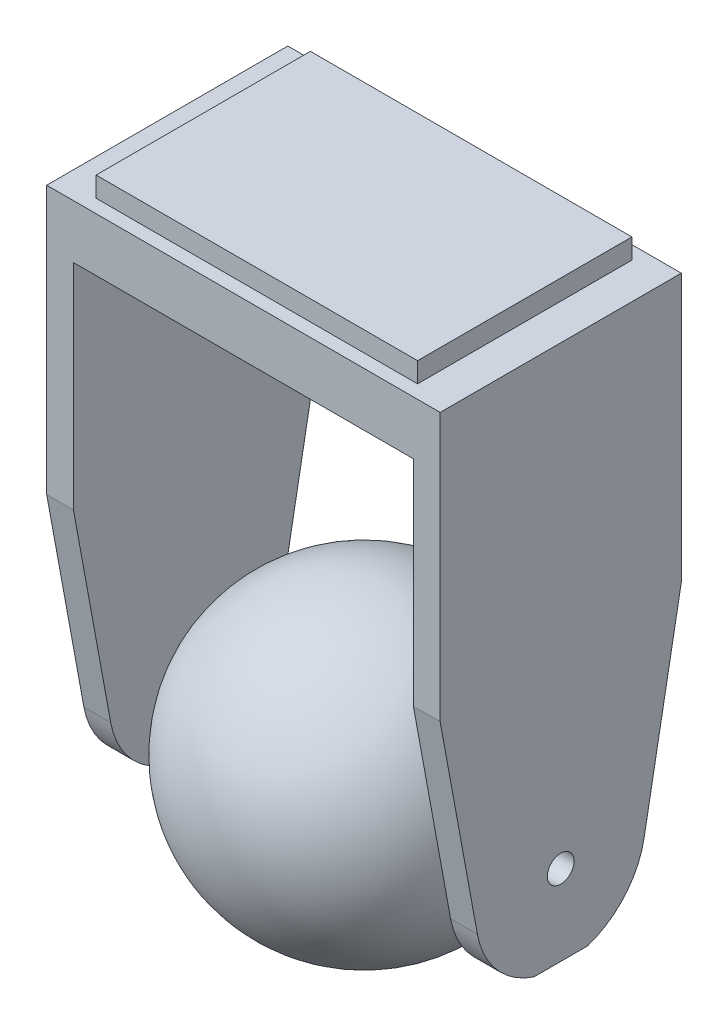
ISO-10303-21;
HEADER;
FILE_DESCRIPTION(('STEP AP214'),'2;1');
FILE_NAME('part.step','',(''),(''),'','','');
FILE_SCHEMA(('AUTOMOTIVE_DESIGN { 1 0 10303 214 1 1 1 1 }'));
ENDSEC;
DATA;
#1=APPLICATION_CONTEXT('core data for automotive mechanical design processes');
#2=APPLICATION_PROTOCOL_DEFINITION('international standard','automotive_design',2000,#1);
#3=PRODUCT_CONTEXT('',#1,'mechanical');
#4=PRODUCT('Part','Part','',(#3));
#5=PRODUCT_RELATED_PRODUCT_CATEGORY('part','',(#4));
#6=PRODUCT_DEFINITION_FORMATION('','',#4);
#7=PRODUCT_DEFINITION_CONTEXT('part definition',#1,'design');
#8=PRODUCT_DEFINITION('design','',#6,#7);
#9=PRODUCT_DEFINITION_SHAPE('','',#8);
#10=(LENGTH_UNIT() NAMED_UNIT(*) SI_UNIT(.MILLI.,.METRE.));
#11=(NAMED_UNIT(*) PLANE_ANGLE_UNIT() SI_UNIT($,.RADIAN.));
#12=(NAMED_UNIT(*) SI_UNIT($,.STERADIAN.) SOLID_ANGLE_UNIT());
#13=UNCERTAINTY_MEASURE_WITH_UNIT(LENGTH_MEASURE(1.E-05),#10,'distance_accuracy_value','');
#14=(GEOMETRIC_REPRESENTATION_CONTEXT(3) GLOBAL_UNCERTAINTY_ASSIGNED_CONTEXT((#13)) GLOBAL_UNIT_ASSIGNED_CONTEXT((#10,
#11,#12)) REPRESENTATION_CONTEXT('',''));
#15=CARTESIAN_POINT('',(0.,0.,0.));
#16=DIRECTION('',(0.,0.,1.));
#17=DIRECTION('',(1.,0.,0.));
#18=AXIS2_PLACEMENT_3D('',#15,#16,#17);
#19=CARTESIAN_POINT('',(0.,-56.35625,0.));
#20=DIRECTION('',(0.,0.,1.));
#21=DIRECTION('',(0.,1.,0.));
#22=AXIS2_PLACEMENT_3D('',#19,#20,#21);
#23=SPHERICAL_SURFACE('',#22,18.034);
#24=CARTESIAN_POINT('',(0.,-56.35625,18.034));
#25=VERTEX_POINT('',#24);
#26=VERTEX_LOOP('',#25);
#27=FACE_BOUND('',#26,.T.);
#28=ADVANCED_FACE('F366',(#27),#23,.T.);
#29=CLOSED_SHELL('',(#28));
#30=MANIFOLD_SOLID_BREP('B2',#29);
#31=CARTESIAN_POINT('',(23.3172,-8.73125,-14.2875));
#32=DIRECTION('',(0.,1.,0.));
#33=DIRECTION('',(0.,0.,1.));
#34=AXIS2_PLACEMENT_3D('',#31,#32,#33);
#35=PLANE('',#34);
#36=DIRECTION('',(0.,0.,1.));
#37=VECTOR('',#36,1.);
#38=CARTESIAN_POINT('',(20.1422,-8.73125,-14.2875));
#39=LINE('',#38,#37);
#40=CARTESIAN_POINT('',(20.1422,-8.73125,-14.2875));
#41=VERTEX_POINT('',#40);
#42=CARTESIAN_POINT('',(20.1422,-8.73125,14.2875));
#43=VERTEX_POINT('',#42);
#44=EDGE_CURVE('E394',#41,#43,#39,.T.);
#45=ORIENTED_EDGE('',*,*,#44,.T.);
#46=DIRECTION('',(-1.,0.,0.));
#47=VECTOR('',#46,1.);
#48=CARTESIAN_POINT('',(23.3172,-8.73125,14.2875));
#49=LINE('',#48,#47);
#50=CARTESIAN_POINT('',(-20.1422,-8.73125,14.2875));
#51=VERTEX_POINT('',#50);
#52=EDGE_CURVE('E380',#43,#51,#49,.T.);
#53=ORIENTED_EDGE('',*,*,#52,.T.);
#54=DIRECTION('',(0.,0.,1.));
#55=VECTOR('',#54,1.);
#56=CARTESIAN_POINT('',(-20.1422,-8.73125,14.2875));
#57=LINE('',#56,#55);
#58=CARTESIAN_POINT('',(-20.1422,-8.73125,-14.2875));
#59=VERTEX_POINT('',#58);
#60=EDGE_CURVE('E621',#59,#51,#57,.T.);
#61=ORIENTED_EDGE('',*,*,#60,.F.);
#62=DIRECTION('',(1.,0.,0.));
#63=VECTOR('',#62,1.);
#64=CARTESIAN_POINT('',(23.3172,-8.73125,-14.2875));
#65=LINE('',#64,#63);
#66=EDGE_CURVE('E399',#59,#41,#65,.T.);
#67=ORIENTED_EDGE('',*,*,#66,.T.);
#68=EDGE_LOOP('',(#45,#53,#61,#67));
#69=FACE_BOUND('',#68,.T.);
#70=ADVANCED_FACE('F376',(#69),#35,.F.);
#71=CARTESIAN_POINT('',(-19.05,-2.38125,-12.7));
#72=DIRECTION('',(-1.,0.,0.));
#73=DIRECTION('',(0.,0.,1.));
#74=AXIS2_PLACEMENT_3D('',#71,#72,#73);
#75=PLANE('',#74);
#76=DIRECTION('',(0.,0.,1.));
#77=VECTOR('',#76,1.);
#78=CARTESIAN_POINT('',(-19.05,0.,-12.7));
#79=LINE('',#78,#77);
#80=CARTESIAN_POINT('',(-19.05,0.,-12.7));
#81=VERTEX_POINT('',#80);
#82=CARTESIAN_POINT('',(-19.05,0.,12.7));
#83=VERTEX_POINT('',#82);
#84=EDGE_CURVE('E525',#81,#83,#79,.T.);
#85=ORIENTED_EDGE('',*,*,#84,.F.);
#86=DIRECTION('',(0.,1.,0.));
#87=VECTOR('',#86,1.);
#88=CARTESIAN_POINT('',(-19.05,-2.38125,-12.7));
#89=LINE('',#88,#87);
#90=CARTESIAN_POINT('',(-19.05,-2.38125,-12.7));
#91=VERTEX_POINT('',#90);
#92=EDGE_CURVE('E364',#91,#81,#89,.T.);
#93=ORIENTED_EDGE('',*,*,#92,.F.);
#94=DIRECTION('',(0.,0.,1.));
#95=VECTOR('',#94,1.);
#96=CARTESIAN_POINT('',(-19.05,-2.38125,-12.7));
#97=LINE('',#96,#95);
#98=CARTESIAN_POINT('',(-19.05,-2.38125,12.7));
#99=VERTEX_POINT('',#98);
#100=EDGE_CURVE('E672',#91,#99,#97,.T.);
#101=ORIENTED_EDGE('',*,*,#100,.T.);
#102=DIRECTION('',(0.,1.,0.));
#103=VECTOR('',#102,1.);
#104=CARTESIAN_POINT('',(-19.05,-2.38125,12.7));
#105=LINE('',#104,#103);
#106=EDGE_CURVE('E683',#99,#83,#105,.T.);
#107=ORIENTED_EDGE('',*,*,#106,.T.);
#108=EDGE_LOOP('',(#85,#93,#101,#107));
#109=FACE_BOUND('',#108,.T.);
#110=ADVANCED_FACE('F378',(#109),#75,.T.);
#111=CARTESIAN_POINT('',(-19.05,-2.38125,-12.7));
#112=DIRECTION('',(0.,0.,-1.));
#113=DIRECTION('',(-1.,0.,0.));
#114=AXIS2_PLACEMENT_3D('',#111,#112,#113);
#115=PLANE('',#114);
#116=DIRECTION('',(-1.,0.,0.));
#117=VECTOR('',#116,1.);
#118=CARTESIAN_POINT('',(-19.05,0.,-12.7));
#119=LINE('',#118,#117);
#120=CARTESIAN_POINT('',(19.05,0.,-12.7));
#121=VERTEX_POINT('',#120);
#122=EDGE_CURVE('E669',#121,#81,#119,.T.);
#123=ORIENTED_EDGE('',*,*,#122,.F.);
#124=DIRECTION('',(0.,1.,0.));
#125=VECTOR('',#124,1.);
#126=CARTESIAN_POINT('',(19.05,-2.38125,-12.7));
#127=LINE('',#126,#125);
#128=CARTESIAN_POINT('',(19.05,-2.38125,-12.7));
#129=VERTEX_POINT('',#128);
#130=EDGE_CURVE('E386',#129,#121,#127,.T.);
#131=ORIENTED_EDGE('',*,*,#130,.F.);
#132=DIRECTION('',(-1.,0.,0.));
#133=VECTOR('',#132,1.);
#134=CARTESIAN_POINT('',(-19.05,-2.38125,-12.7));
#135=LINE('',#134,#133);
#136=EDGE_CURVE('E681',#129,#91,#135,.T.);
#137=ORIENTED_EDGE('',*,*,#136,.T.);
#138=ORIENTED_EDGE('',*,*,#92,.T.);
#139=EDGE_LOOP('',(#123,#131,#137,#138));
#140=FACE_BOUND('',#139,.T.);
#141=ADVANCED_FACE('F701',(#140),#115,.T.);
#142=CARTESIAN_POINT('',(19.05,-2.38125,-12.7));
#143=DIRECTION('',(1.,0.,0.));
#144=DIRECTION('',(0.,0.,-1.));
#145=AXIS2_PLACEMENT_3D('',#142,#143,#144);
#146=PLANE('',#145);
#147=DIRECTION('',(0.,0.,-1.));
#148=VECTOR('',#147,1.);
#149=CARTESIAN_POINT('',(19.05,0.,-12.7));
#150=LINE('',#149,#148);
#151=CARTESIAN_POINT('',(19.05,0.,12.7));
#152=VERTEX_POINT('',#151);
#153=EDGE_CURVE('E666',#152,#121,#150,.T.);
#154=ORIENTED_EDGE('',*,*,#153,.F.);
#155=DIRECTION('',(0.,1.,0.));
#156=VECTOR('',#155,1.);
#157=CARTESIAN_POINT('',(19.05,-2.38125,12.7));
#158=LINE('',#157,#156);
#159=CARTESIAN_POINT('',(19.05,-2.38125,12.7));
#160=VERTEX_POINT('',#159);
#161=EDGE_CURVE('E686',#160,#152,#158,.T.);
#162=ORIENTED_EDGE('',*,*,#161,.F.);
#163=DIRECTION('',(0.,0.,-1.));
#164=VECTOR('',#163,1.);
#165=CARTESIAN_POINT('',(19.05,-2.38125,-12.7));
#166=LINE('',#165,#164);
#167=EDGE_CURVE('E678',#160,#129,#166,.T.);
#168=ORIENTED_EDGE('',*,*,#167,.T.);
#169=ORIENTED_EDGE('',*,*,#130,.T.);
#170=EDGE_LOOP('',(#154,#162,#168,#169));
#171=FACE_BOUND('',#170,.T.);
#172=ADVANCED_FACE('F706',(#171),#146,.T.);
#173=CARTESIAN_POINT('',(-19.05,-2.38125,12.7));
#174=DIRECTION('',(0.,0.,1.));
#175=DIRECTION('',(1.,0.,0.));
#176=AXIS2_PLACEMENT_3D('',#173,#174,#175);
#177=PLANE('',#176);
#178=DIRECTION('',(1.,0.,0.));
#179=VECTOR('',#178,1.);
#180=CARTESIAN_POINT('',(-19.05,0.,12.7));
#181=LINE('',#180,#179);
#182=EDGE_CURVE('E663',#83,#152,#181,.T.);
#183=ORIENTED_EDGE('',*,*,#182,.F.);
#184=ORIENTED_EDGE('',*,*,#106,.F.);
#185=DIRECTION('',(1.,0.,0.));
#186=VECTOR('',#185,1.);
#187=CARTESIAN_POINT('',(-19.05,-2.38125,12.7));
#188=LINE('',#187,#186);
#189=EDGE_CURVE('E675',#99,#160,#188,.T.);
#190=ORIENTED_EDGE('',*,*,#189,.T.);
#191=ORIENTED_EDGE('',*,*,#161,.T.);
#192=EDGE_LOOP('',(#183,#184,#190,#191));
#193=FACE_BOUND('',#192,.T.);
#194=ADVANCED_FACE('F693',(#193),#177,.T.);
#195=CARTESIAN_POINT('',(-19.05,0.,12.7));
#196=DIRECTION('',(0.,1.,0.));
#197=DIRECTION('',(0.,0.,1.));
#198=AXIS2_PLACEMENT_3D('',#195,#196,#197);
#199=PLANE('',#198);
#200=ORIENTED_EDGE('',*,*,#84,.T.);
#201=ORIENTED_EDGE('',*,*,#182,.T.);
#202=ORIENTED_EDGE('',*,*,#153,.T.);
#203=ORIENTED_EDGE('',*,*,#122,.T.);
#204=EDGE_LOOP('',(#200,#201,#202,#203));
#205=FACE_BOUND('',#204,.T.);
#206=ADVANCED_FACE('F697',(#205),#199,.T.);
#207=CARTESIAN_POINT('',(23.3172,-8.73125,14.2875));
#208=DIRECTION('',(-1.,0.,0.));
#209=DIRECTION('',(0.,0.,1.));
#210=AXIS2_PLACEMENT_3D('',#207,#208,#209);
#211=PLANE('',#210);
#212=DIRECTION('',(0.,0.,1.));
#213=VECTOR('',#212,1.);
#214=CARTESIAN_POINT('',(23.3172,-2.38125,14.2875));
#215=LINE('',#214,#213);
#216=CARTESIAN_POINT('',(23.3172,-2.38125,-14.2875));
#217=VERTEX_POINT('',#216);
#218=CARTESIAN_POINT('',(23.3172,-2.38125,14.2875));
#219=VERTEX_POINT('',#218);
#220=EDGE_CURVE('E523',#217,#219,#215,.T.);
#221=ORIENTED_EDGE('',*,*,#220,.T.);
#222=DIRECTION('',(0.,1.,0.));
#223=VECTOR('',#222,1.);
#224=CARTESIAN_POINT('',(23.3172,-8.73125,14.2875));
#225=LINE('',#224,#223);
#226=CARTESIAN_POINT('',(23.3172,-34.13125,14.2875));
#227=VERTEX_POINT('',#226);
#228=EDGE_CURVE('E514',#227,#219,#225,.T.);
#229=ORIENTED_EDGE('',*,*,#228,.F.);
#230=DIRECTION('',(0.,-0.983567719638267,-0.180539582600546));
#231=VECTOR('',#230,1.);
#232=CARTESIAN_POINT('',(23.3172,-34.13125,14.2875));
#233=LINE('',#232,#231);
#234=CARTESIAN_POINT('',(23.3172,-58.1689092170474,9.87524767096264));
#235=VERTEX_POINT('',#234);
#236=EDGE_CURVE('E520',#227,#235,#233,.T.);
#237=ORIENTED_EDGE('',*,*,#236,.T.);
#238=CARTESIAN_POINT('',(23.3172,-56.35625,0.));
#239=DIRECTION('',(1.,0.,0.));
#240=DIRECTION('',(0.,0.,-1.));
#241=AXIS2_PLACEMENT_3D('',#238,#239,#240);
#242=CIRCLE('',#241,10.0402315710346);
#243=CARTESIAN_POINT('',(23.3172,-65.88125,3.175));
#244=VERTEX_POINT('',#243);
#245=EDGE_CURVE('E541',#235,#244,#242,.T.);
#246=ORIENTED_EDGE('',*,*,#245,.T.);
#247=DIRECTION('',(0.,0.,-1.));
#248=VECTOR('',#247,1.);
#249=CARTESIAN_POINT('',(23.3172,-65.88125,3.175));
#250=LINE('',#249,#248);
#251=CARTESIAN_POINT('',(23.3172,-65.88125,-3.175));
#252=VERTEX_POINT('',#251);
#253=EDGE_CURVE('E544',#244,#252,#250,.T.);
#254=ORIENTED_EDGE('',*,*,#253,.T.);
#255=CARTESIAN_POINT('',(23.3172,-56.35625,0.));
#256=DIRECTION('',(1.,0.,0.));
#257=DIRECTION('',(0.,0.,-1.));
#258=AXIS2_PLACEMENT_3D('',#255,#256,#257);
#259=CIRCLE('',#258,10.0402315710346);
#260=CARTESIAN_POINT('',(23.3172,-58.1689092170474,-9.87524767096263));
#261=VERTEX_POINT('',#260);
#262=EDGE_CURVE('E553',#252,#261,#259,.T.);
#263=ORIENTED_EDGE('',*,*,#262,.T.);
#264=DIRECTION('',(0.,0.983567719638267,-0.180539582600546));
#265=VECTOR('',#264,1.);
#266=CARTESIAN_POINT('',(23.3172,-58.1689092170474,-9.87524767096263));
#267=LINE('',#266,#265);
#268=CARTESIAN_POINT('',(23.3172,-34.13125,-14.2875));
#269=VERTEX_POINT('',#268);
#270=EDGE_CURVE('E556',#261,#269,#267,.T.);
#271=ORIENTED_EDGE('',*,*,#270,.T.);
#272=DIRECTION('',(0.,1.,0.));
#273=VECTOR('',#272,1.);
#274=CARTESIAN_POINT('',(23.3172,-8.73125,-14.2875));
#275=LINE('',#274,#273);
#276=EDGE_CURVE('E645',#269,#217,#275,.T.);
#277=ORIENTED_EDGE('',*,*,#276,.T.);
#278=EDGE_LOOP('',(#221,#229,#237,#246,#254,#263,#271,#277));
#279=FACE_BOUND('',#278,.T.);
#280=CARTESIAN_POINT('',(23.3172,-56.35625,0.));
#281=DIRECTION('',(1.,0.,0.));
#282=DIRECTION('',(0.,0.,-1.));
#283=AXIS2_PLACEMENT_3D('',#280,#281,#282);
#284=CIRCLE('',#283,1.5875);
#285=CARTESIAN_POINT('',(23.3172,-56.35625,-1.58750000000001));
#286=VERTEX_POINT('',#285);
#287=EDGE_CURVE('E547',#286,#286,#284,.T.);
#288=ORIENTED_EDGE('',*,*,#287,.F.);
#289=EDGE_LOOP('',(#288));
#290=FACE_BOUND('',#289,.T.);
#291=ADVANCED_FACE('F516',(#279,#290),#211,.F.);
#292=CARTESIAN_POINT('',(23.3172,-8.73125,14.2875));
#293=DIRECTION('',(0.,0.,-1.));
#294=DIRECTION('',(-1.,0.,0.));
#295=AXIS2_PLACEMENT_3D('',#292,#293,#294);
#296=PLANE('',#295);
#297=DIRECTION('',(-1.,0.,0.));
#298=VECTOR('',#297,1.);
#299=CARTESIAN_POINT('',(23.3172,-2.38125,14.2875));
#300=LINE('',#299,#298);
#301=CARTESIAN_POINT('',(-23.3172,-2.38125,14.2875));
#302=VERTEX_POINT('',#301);
#303=EDGE_CURVE('E652',#219,#302,#300,.T.);
#304=ORIENTED_EDGE('',*,*,#303,.T.);
#305=DIRECTION('',(0.,1.,0.));
#306=VECTOR('',#305,1.);
#307=CARTESIAN_POINT('',(-23.3172,-8.73125,14.2875));
#308=LINE('',#307,#306);
#309=CARTESIAN_POINT('',(-23.3172,-34.13125,14.2875));
#310=VERTEX_POINT('',#309);
#311=EDGE_CURVE('E526',#310,#302,#308,.T.);
#312=ORIENTED_EDGE('',*,*,#311,.F.);
#313=DIRECTION('',(-1.,0.,0.));
#314=VECTOR('',#313,1.);
#315=CARTESIAN_POINT('',(-20.1422,-34.13125,14.2875));
#316=LINE('',#315,#314);
#317=CARTESIAN_POINT('',(-20.1422,-34.13125,14.2875));
#318=VERTEX_POINT('',#317);
#319=EDGE_CURVE('E906',#318,#310,#316,.T.);
#320=ORIENTED_EDGE('',*,*,#319,.F.);
#321=DIRECTION('',(0.,-1.,0.));
#322=VECTOR('',#321,1.);
#323=CARTESIAN_POINT('',(-20.1422,-8.73125,14.2875));
#324=LINE('',#323,#322);
#325=EDGE_CURVE('E604',#51,#318,#324,.T.);
#326=ORIENTED_EDGE('',*,*,#325,.F.);
#327=ORIENTED_EDGE('',*,*,#52,.F.);
#328=DIRECTION('',(0.,-1.,0.));
#329=VECTOR('',#328,1.);
#330=CARTESIAN_POINT('',(20.1422,-8.73125,14.2875));
#331=LINE('',#330,#329);
#332=CARTESIAN_POINT('',(20.1422,-34.13125,14.2875));
#333=VERTEX_POINT('',#332);
#334=EDGE_CURVE('E532',#43,#333,#331,.T.);
#335=ORIENTED_EDGE('',*,*,#334,.T.);
#336=DIRECTION('',(1.,0.,0.));
#337=VECTOR('',#336,1.);
#338=CARTESIAN_POINT('',(20.1422,-34.13125,14.2875));
#339=LINE('',#338,#337);
#340=EDGE_CURVE('E529',#333,#227,#339,.T.);
#341=ORIENTED_EDGE('',*,*,#340,.T.);
#342=ORIENTED_EDGE('',*,*,#228,.T.);
#343=EDGE_LOOP('',(#304,#312,#320,#326,#327,#335,#341,#342));
#344=FACE_BOUND('',#343,.T.);
#345=ADVANCED_FACE('F530',(#344),#296,.F.);
#346=CARTESIAN_POINT('',(-23.3172,-8.73125,14.2875));
#347=DIRECTION('',(1.,0.,0.));
#348=DIRECTION('',(0.,0.,-1.));
#349=AXIS2_PLACEMENT_3D('',#346,#347,#348);
#350=PLANE('',#349);
#351=DIRECTION('',(0.,0.,-1.));
#352=VECTOR('',#351,1.);
#353=CARTESIAN_POINT('',(-23.3172,-2.38125,14.2875));
#354=LINE('',#353,#352);
#355=CARTESIAN_POINT('',(-23.3172,-2.38125,-14.2875));
#356=VERTEX_POINT('',#355);
#357=EDGE_CURVE('E649',#302,#356,#354,.T.);
#358=ORIENTED_EDGE('',*,*,#357,.T.);
#359=DIRECTION('',(0.,1.,0.));
#360=VECTOR('',#359,1.);
#361=CARTESIAN_POINT('',(-23.3172,-8.73125,-14.2875));
#362=LINE('',#361,#360);
#363=CARTESIAN_POINT('',(-23.3172,-34.13125,-14.2875));
#364=VERTEX_POINT('',#363);
#365=EDGE_CURVE('E646',#364,#356,#362,.T.);
#366=ORIENTED_EDGE('',*,*,#365,.F.);
#367=DIRECTION('',(0.,0.983567719638267,-0.180539582600546));
#368=VECTOR('',#367,1.);
#369=CARTESIAN_POINT('',(-23.3172,-34.13125,-14.2875));
#370=LINE('',#369,#368);
#371=CARTESIAN_POINT('',(-23.3172,-58.1689092170474,-9.87524767096264));
#372=VERTEX_POINT('',#371);
#373=EDGE_CURVE('E601',#372,#364,#370,.T.);
#374=ORIENTED_EDGE('',*,*,#373,.F.);
#375=CARTESIAN_POINT('',(-23.3172,-56.35625,0.));
#376=DIRECTION('',(1.,0.,0.));
#377=DIRECTION('',(0.,0.,1.));
#378=AXIS2_PLACEMENT_3D('',#375,#376,#377);
#379=CIRCLE('',#378,10.0402315710346);
#380=CARTESIAN_POINT('',(-23.3172,-65.88125,-3.17500000000001));
#381=VERTEX_POINT('',#380);
#382=EDGE_CURVE('E599',#381,#372,#379,.T.);
#383=ORIENTED_EDGE('',*,*,#382,.F.);
#384=DIRECTION('',(0.,0.,-1.));
#385=VECTOR('',#384,1.);
#386=CARTESIAN_POINT('',(-23.3172,-65.88125,-3.17500000000001));
#387=LINE('',#386,#385);
#388=CARTESIAN_POINT('',(-23.3172,-65.88125,3.17499999999999));
#389=VERTEX_POINT('',#388);
#390=EDGE_CURVE('E597',#389,#381,#387,.T.);
#391=ORIENTED_EDGE('',*,*,#390,.F.);
#392=CARTESIAN_POINT('',(-23.3172,-56.35625,0.));
#393=DIRECTION('',(1.,0.,0.));
#394=DIRECTION('',(0.,0.,-1.));
#395=AXIS2_PLACEMENT_3D('',#392,#393,#394);
#396=CIRCLE('',#395,10.0402315710346);
#397=CARTESIAN_POINT('',(-23.3172,-58.1689092170474,9.87524767096264));
#398=VERTEX_POINT('',#397);
#399=EDGE_CURVE('E595',#398,#389,#396,.T.);
#400=ORIENTED_EDGE('',*,*,#399,.F.);
#401=DIRECTION('',(0.,-0.983567719638267,-0.180539582600546));
#402=VECTOR('',#401,1.);
#403=CARTESIAN_POINT('',(-23.3172,-34.13125,14.2875));
#404=LINE('',#403,#402);
#405=EDGE_CURVE('E593',#310,#398,#404,.T.);
#406=ORIENTED_EDGE('',*,*,#405,.F.);
#407=ORIENTED_EDGE('',*,*,#311,.T.);
#408=EDGE_LOOP('',(#358,#366,#374,#383,#391,#400,#406,#407));
#409=FACE_BOUND('',#408,.T.);
#410=CARTESIAN_POINT('',(-23.3172,-56.35625,0.));
#411=DIRECTION('',(1.,0.,0.));
#412=DIRECTION('',(0.,0.,-1.));
#413=AXIS2_PLACEMENT_3D('',#410,#411,#412);
#414=CIRCLE('',#413,1.5875);
#415=CARTESIAN_POINT('',(-23.3172,-56.35625,-1.58750000000001));
#416=VERTEX_POINT('',#415);
#417=EDGE_CURVE('E580',#416,#416,#414,.T.);
#418=ORIENTED_EDGE('',*,*,#417,.T.);
#419=EDGE_LOOP('',(#418));
#420=FACE_BOUND('',#419,.T.);
#421=ADVANCED_FACE('F726',(#409,#420),#350,.F.);
#422=CARTESIAN_POINT('',(23.3172,-8.73125,-14.2875));
#423=DIRECTION('',(0.,0.,1.));
#424=DIRECTION('',(1.,0.,0.));
#425=AXIS2_PLACEMENT_3D('',#422,#423,#424);
#426=PLANE('',#425);
#427=DIRECTION('',(1.,0.,0.));
#428=VECTOR('',#427,1.);
#429=CARTESIAN_POINT('',(23.3172,-2.38125,-14.2875));
#430=LINE('',#429,#428);
#431=EDGE_CURVE('E648',#356,#217,#430,.T.);
#432=ORIENTED_EDGE('',*,*,#431,.T.);
#433=ORIENTED_EDGE('',*,*,#276,.F.);
#434=DIRECTION('',(1.,0.,0.));
#435=VECTOR('',#434,1.);
#436=CARTESIAN_POINT('',(20.1422,-34.13125,-14.2875));
#437=LINE('',#436,#435);
#438=CARTESIAN_POINT('',(20.1422,-34.13125,-14.2875));
#439=VERTEX_POINT('',#438);
#440=EDGE_CURVE('E577',#439,#269,#437,.T.);
#441=ORIENTED_EDGE('',*,*,#440,.F.);
#442=DIRECTION('',(0.,1.,0.));
#443=VECTOR('',#442,1.);
#444=CARTESIAN_POINT('',(20.1422,-34.13125,-14.2875));
#445=LINE('',#444,#443);
#446=EDGE_CURVE('E537',#439,#41,#445,.T.);
#447=ORIENTED_EDGE('',*,*,#446,.T.);
#448=ORIENTED_EDGE('',*,*,#66,.F.);
#449=DIRECTION('',(0.,1.,0.));
#450=VECTOR('',#449,1.);
#451=CARTESIAN_POINT('',(-20.1422,-8.73125,-14.2875));
#452=LINE('',#451,#450);
#453=CARTESIAN_POINT('',(-20.1422,-34.13125,-14.2875));
#454=VERTEX_POINT('',#453);
#455=EDGE_CURVE('E615',#454,#59,#452,.T.);
#456=ORIENTED_EDGE('',*,*,#455,.F.);
#457=DIRECTION('',(-1.,0.,0.));
#458=VECTOR('',#457,1.);
#459=CARTESIAN_POINT('',(-20.1422,-34.13125,-14.2875));
#460=LINE('',#459,#458);
#461=EDGE_CURVE('E618',#454,#364,#460,.T.);
#462=ORIENTED_EDGE('',*,*,#461,.T.);
#463=ORIENTED_EDGE('',*,*,#365,.T.);
#464=EDGE_LOOP('',(#432,#433,#441,#447,#448,#456,#462,#463));
#465=FACE_BOUND('',#464,.T.);
#466=ADVANCED_FACE('F642',(#465),#426,.F.);
#467=CARTESIAN_POINT('',(23.3172,-2.38125,-14.2875));
#468=DIRECTION('',(0.,1.,0.));
#469=DIRECTION('',(0.,0.,1.));
#470=AXIS2_PLACEMENT_3D('',#467,#468,#469);
#471=PLANE('',#470);
#472=ORIENTED_EDGE('',*,*,#189,.F.);
#473=ORIENTED_EDGE('',*,*,#100,.F.);
#474=ORIENTED_EDGE('',*,*,#136,.F.);
#475=ORIENTED_EDGE('',*,*,#167,.F.);
#476=EDGE_LOOP('',(#472,#473,#474,#475));
#477=FACE_BOUND('',#476,.T.);
#478=ORIENTED_EDGE('',*,*,#220,.F.);
#479=ORIENTED_EDGE('',*,*,#431,.F.);
#480=ORIENTED_EDGE('',*,*,#357,.F.);
#481=ORIENTED_EDGE('',*,*,#303,.F.);
#482=EDGE_LOOP('',(#478,#479,#480,#481));
#483=FACE_BOUND('',#482,.T.);
#484=ADVANCED_FACE('F703',(#477,#483),#471,.T.);
#485=CARTESIAN_POINT('',(-20.1422,-56.35625,0.));
#486=DIRECTION('',(1.,0.,0.));
#487=DIRECTION('',(0.,0.,-1.));
#488=AXIS2_PLACEMENT_3D('',#485,#486,#487);
#489=PLANE('',#488);
#490=ORIENTED_EDGE('',*,*,#325,.T.);
#491=DIRECTION('',(0.,-0.983567719638267,-0.180539582600546));
#492=VECTOR('',#491,1.);
#493=CARTESIAN_POINT('',(-20.1422,-34.13125,14.2875));
#494=LINE('',#493,#492);
#495=CARTESIAN_POINT('',(-20.1422,-58.1689092170474,9.87524767096264));
#496=VERTEX_POINT('',#495);
#497=EDGE_CURVE('E605',#318,#496,#494,.T.);
#498=ORIENTED_EDGE('',*,*,#497,.T.);
#499=CARTESIAN_POINT('',(-20.1422,-56.35625,0.));
#500=DIRECTION('',(1.,0.,0.));
#501=DIRECTION('',(0.,0.,-1.));
#502=AXIS2_PLACEMENT_3D('',#499,#500,#501);
#503=CIRCLE('',#502,10.0402315710346);
#504=CARTESIAN_POINT('',(-20.1422,-65.88125,3.17499999999999));
#505=VERTEX_POINT('',#504);
#506=EDGE_CURVE('E607',#496,#505,#503,.T.);
#507=ORIENTED_EDGE('',*,*,#506,.T.);
#508=DIRECTION('',(0.,0.,-1.));
#509=VECTOR('',#508,1.);
#510=CARTESIAN_POINT('',(-20.1422,-65.88125,-3.17500000000001));
#511=LINE('',#510,#509);
#512=CARTESIAN_POINT('',(-20.1422,-65.88125,-3.17500000000001));
#513=VERTEX_POINT('',#512);
#514=EDGE_CURVE('E609',#505,#513,#511,.T.);
#515=ORIENTED_EDGE('',*,*,#514,.T.);
#516=CARTESIAN_POINT('',(-20.1422,-56.35625,0.));
#517=DIRECTION('',(1.,0.,0.));
#518=DIRECTION('',(0.,0.,1.));
#519=AXIS2_PLACEMENT_3D('',#516,#517,#518);
#520=CIRCLE('',#519,10.0402315710346);
#521=CARTESIAN_POINT('',(-20.1422,-58.1689092170474,-9.87524767096264));
#522=VERTEX_POINT('',#521);
#523=EDGE_CURVE('E611',#513,#522,#520,.T.);
#524=ORIENTED_EDGE('',*,*,#523,.T.);
#525=DIRECTION('',(0.,0.983567719638267,-0.180539582600546));
#526=VECTOR('',#525,1.);
#527=CARTESIAN_POINT('',(-20.1422,-34.13125,-14.2875));
#528=LINE('',#527,#526);
#529=EDGE_CURVE('E613',#522,#454,#528,.T.);
#530=ORIENTED_EDGE('',*,*,#529,.T.);
#531=ORIENTED_EDGE('',*,*,#455,.T.);
#532=ORIENTED_EDGE('',*,*,#60,.T.);
#533=EDGE_LOOP('',(#490,#498,#507,#515,#524,#530,#531,#532));
#534=FACE_BOUND('',#533,.T.);
#535=CARTESIAN_POINT('',(-20.1422,-56.35625,0.));
#536=DIRECTION('',(1.,0.,0.));
#537=DIRECTION('',(0.,0.,-1.));
#538=AXIS2_PLACEMENT_3D('',#535,#536,#537);
#539=CIRCLE('',#538,1.5875);
#540=CARTESIAN_POINT('',(-20.1422,-56.35625,-1.58750000000001));
#541=VERTEX_POINT('',#540);
#542=EDGE_CURVE('E590',#541,#541,#539,.T.);
#543=ORIENTED_EDGE('',*,*,#542,.F.);
#544=EDGE_LOOP('',(#543));
#545=FACE_BOUND('',#544,.T.);
#546=ADVANCED_FACE('F635',(#534,#545),#489,.T.);
#547=CARTESIAN_POINT('',(-20.1422,-34.13125,14.2875));
#548=DIRECTION('',(0.,0.180539582600546,-0.983567719638267));
#549=DIRECTION('',(0.,0.983567719638267,0.180539582600546));
#550=AXIS2_PLACEMENT_3D('',#547,#548,#549);
#551=PLANE('',#550);
#552=ORIENTED_EDGE('',*,*,#405,.T.);
#553=DIRECTION('',(-1.,0.,0.));
#554=VECTOR('',#553,1.);
#555=CARTESIAN_POINT('',(-20.1422,-58.1689092170474,9.87524767096264));
#556=LINE('',#555,#554);
#557=EDGE_CURVE('E909',#496,#398,#556,.T.);
#558=ORIENTED_EDGE('',*,*,#557,.F.);
#559=ORIENTED_EDGE('',*,*,#497,.F.);
#560=ORIENTED_EDGE('',*,*,#319,.T.);
#561=EDGE_LOOP('',(#552,#558,#559,#560));
#562=FACE_BOUND('',#561,.T.);
#563=ADVANCED_FACE('F770',(#562),#551,.F.);
#564=CARTESIAN_POINT('',(-20.1422,-56.35625,0.));
#565=DIRECTION('',(-1.,0.,0.));
#566=DIRECTION('',(0.,0.,1.));
#567=AXIS2_PLACEMENT_3D('',#564,#565,#566);
#568=CYLINDRICAL_SURFACE('',#567,10.0402315710346);
#569=ORIENTED_EDGE('',*,*,#399,.T.);
#570=DIRECTION('',(-1.,0.,0.));
#571=VECTOR('',#570,1.);
#572=CARTESIAN_POINT('',(-20.1422,-65.88125,3.17499999999999));
#573=LINE('',#572,#571);
#574=EDGE_CURVE('E914',#505,#389,#573,.T.);
#575=ORIENTED_EDGE('',*,*,#574,.F.);
#576=ORIENTED_EDGE('',*,*,#506,.F.);
#577=ORIENTED_EDGE('',*,*,#557,.T.);
#578=EDGE_LOOP('',(#569,#575,#576,#577));
#579=FACE_BOUND('',#578,.T.);
#580=ADVANCED_FACE('F777',(#579),#568,.T.);
#581=CARTESIAN_POINT('',(-20.1422,-65.88125,-3.17500000000001));
#582=DIRECTION('',(0.,1.,0.));
#583=DIRECTION('',(0.,0.,1.));
#584=AXIS2_PLACEMENT_3D('',#581,#582,#583);
#585=PLANE('',#584);
#586=ORIENTED_EDGE('',*,*,#390,.T.);
#587=DIRECTION('',(-1.,0.,0.));
#588=VECTOR('',#587,1.);
#589=CARTESIAN_POINT('',(-20.1422,-65.88125,-3.17500000000001));
#590=LINE('',#589,#588);
#591=EDGE_CURVE('E917',#513,#381,#590,.T.);
#592=ORIENTED_EDGE('',*,*,#591,.F.);
#593=ORIENTED_EDGE('',*,*,#514,.F.);
#594=ORIENTED_EDGE('',*,*,#574,.T.);
#595=EDGE_LOOP('',(#586,#592,#593,#594));
#596=FACE_BOUND('',#595,.T.);
#597=ADVANCED_FACE('F784',(#596),#585,.F.);
#598=CARTESIAN_POINT('',(-20.1422,-56.35625,0.));
#599=DIRECTION('',(-1.,0.,0.));
#600=DIRECTION('',(0.,0.,1.));
#601=AXIS2_PLACEMENT_3D('',#598,#599,#600);
#602=CYLINDRICAL_SURFACE('',#601,10.0402315710346);
#603=ORIENTED_EDGE('',*,*,#382,.T.);
#604=DIRECTION('',(-1.,0.,0.));
#605=VECTOR('',#604,1.);
#606=CARTESIAN_POINT('',(-20.1422,-58.1689092170474,-9.87524767096264));
#607=LINE('',#606,#605);
#608=EDGE_CURVE('E919',#522,#372,#607,.T.);
#609=ORIENTED_EDGE('',*,*,#608,.F.);
#610=ORIENTED_EDGE('',*,*,#523,.F.);
#611=ORIENTED_EDGE('',*,*,#591,.T.);
#612=EDGE_LOOP('',(#603,#609,#610,#611));
#613=FACE_BOUND('',#612,.T.);
#614=ADVANCED_FACE('F792',(#613),#602,.T.);
#615=CARTESIAN_POINT('',(-20.1422,-34.13125,-14.2875));
#616=DIRECTION('',(0.,0.180539582600546,0.983567719638267));
#617=DIRECTION('',(0.,-0.983567719638267,0.180539582600546));
#618=AXIS2_PLACEMENT_3D('',#615,#616,#617);
#619=PLANE('',#618);
#620=ORIENTED_EDGE('',*,*,#373,.T.);
#621=ORIENTED_EDGE('',*,*,#461,.F.);
#622=ORIENTED_EDGE('',*,*,#529,.F.);
#623=ORIENTED_EDGE('',*,*,#608,.T.);
#624=EDGE_LOOP('',(#620,#621,#622,#623));
#625=FACE_BOUND('',#624,.T.);
#626=ADVANCED_FACE('F800',(#625),#619,.F.);
#627=CARTESIAN_POINT('',(-20.1422,-56.35625,0.));
#628=DIRECTION('',(-1.,0.,0.));
#629=DIRECTION('',(0.,0.,1.));
#630=AXIS2_PLACEMENT_3D('',#627,#628,#629);
#631=CYLINDRICAL_SURFACE('',#630,1.5875);
#632=ORIENTED_EDGE('',*,*,#542,.T.);
#633=EDGE_LOOP('',(#632));
#634=FACE_BOUND('',#633,.T.);
#635=ORIENTED_EDGE('',*,*,#417,.F.);
#636=EDGE_LOOP('',(#635));
#637=FACE_BOUND('',#636,.T.);
#638=ADVANCED_FACE('F807',(#634,#637),#631,.F.);
#639=CARTESIAN_POINT('',(20.1422,-58.1689092170474,-9.87524767096263));
#640=DIRECTION('',(0.,-0.180539582600546,-0.983567719638267));
#641=DIRECTION('',(0.,0.983567719638267,-0.180539582600546));
#642=AXIS2_PLACEMENT_3D('',#639,#640,#641);
#643=PLANE('',#642);
#644=ORIENTED_EDGE('',*,*,#270,.F.);
#645=DIRECTION('',(1.,0.,0.));
#646=VECTOR('',#645,1.);
#647=CARTESIAN_POINT('',(20.1422,-58.1689092170474,-9.87524767096263));
#648=LINE('',#647,#646);
#649=CARTESIAN_POINT('',(20.1422,-58.1689092170474,-9.87524767096263));
#650=VERTEX_POINT('',#649);
#651=EDGE_CURVE('E581',#650,#261,#648,.T.);
#652=ORIENTED_EDGE('',*,*,#651,.F.);
#653=DIRECTION('',(0.,0.983567719638267,-0.180539582600546));
#654=VECTOR('',#653,1.);
#655=CARTESIAN_POINT('',(20.1422,-58.1689092170474,-9.87524767096263));
#656=LINE('',#655,#654);
#657=EDGE_CURVE('E572',#650,#439,#656,.T.);
#658=ORIENTED_EDGE('',*,*,#657,.T.);
#659=ORIENTED_EDGE('',*,*,#440,.T.);
#660=EDGE_LOOP('',(#644,#652,#658,#659));
#661=FACE_BOUND('',#660,.T.);
#662=ADVANCED_FACE('F814',(#661),#643,.T.);
#663=CARTESIAN_POINT('',(20.1422,-56.35625,0.));
#664=DIRECTION('',(1.,0.,0.));
#665=DIRECTION('',(0.,0.,-1.));
#666=AXIS2_PLACEMENT_3D('',#663,#664,#665);
#667=CYLINDRICAL_SURFACE('',#666,10.0402315710346);
#668=ORIENTED_EDGE('',*,*,#262,.F.);
#669=DIRECTION('',(1.,0.,0.));
#670=VECTOR('',#669,1.);
#671=CARTESIAN_POINT('',(20.1422,-65.88125,-3.175));
#672=LINE('',#671,#670);
#673=CARTESIAN_POINT('',(20.1422,-65.88125,-3.175));
#674=VERTEX_POINT('',#673);
#675=EDGE_CURVE('E583',#674,#252,#672,.T.);
#676=ORIENTED_EDGE('',*,*,#675,.F.);
#677=CARTESIAN_POINT('',(20.1422,-56.35625,0.));
#678=DIRECTION('',(1.,0.,0.));
#679=DIRECTION('',(0.,0.,-1.));
#680=AXIS2_PLACEMENT_3D('',#677,#678,#679);
#681=CIRCLE('',#680,10.0402315710346);
#682=EDGE_CURVE('E569',#674,#650,#681,.T.);
#683=ORIENTED_EDGE('',*,*,#682,.T.);
#684=ORIENTED_EDGE('',*,*,#651,.T.);
#685=EDGE_LOOP('',(#668,#676,#683,#684));
#686=FACE_BOUND('',#685,.T.);
#687=ADVANCED_FACE('F845',(#686),#667,.T.);
#688=CARTESIAN_POINT('',(20.1422,-65.88125,3.175));
#689=DIRECTION('',(0.,-1.,0.));
#690=DIRECTION('',(0.,0.,-1.));
#691=AXIS2_PLACEMENT_3D('',#688,#689,#690);
#692=PLANE('',#691);
#693=ORIENTED_EDGE('',*,*,#253,.F.);
#694=DIRECTION('',(1.,0.,0.));
#695=VECTOR('',#694,1.);
#696=CARTESIAN_POINT('',(20.1422,-65.88125,3.175));
#697=LINE('',#696,#695);
#698=CARTESIAN_POINT('',(20.1422,-65.88125,3.175));
#699=VERTEX_POINT('',#698);
#700=EDGE_CURVE('E585',#699,#244,#697,.T.);
#701=ORIENTED_EDGE('',*,*,#700,.F.);
#702=DIRECTION('',(0.,0.,-1.));
#703=VECTOR('',#702,1.);
#704=CARTESIAN_POINT('',(20.1422,-65.88125,3.175));
#705=LINE('',#704,#703);
#706=EDGE_CURVE('E566',#699,#674,#705,.T.);
#707=ORIENTED_EDGE('',*,*,#706,.T.);
#708=ORIENTED_EDGE('',*,*,#675,.T.);
#709=EDGE_LOOP('',(#693,#701,#707,#708));
#710=FACE_BOUND('',#709,.T.);
#711=ADVANCED_FACE('F853',(#710),#692,.T.);
#712=CARTESIAN_POINT('',(20.1422,-56.35625,0.));
#713=DIRECTION('',(1.,0.,0.));
#714=DIRECTION('',(0.,0.,-1.));
#715=AXIS2_PLACEMENT_3D('',#712,#713,#714);
#716=CYLINDRICAL_SURFACE('',#715,10.0402315710346);
#717=ORIENTED_EDGE('',*,*,#245,.F.);
#718=DIRECTION('',(1.,0.,0.));
#719=VECTOR('',#718,1.);
#720=CARTESIAN_POINT('',(20.1422,-58.1689092170474,9.87524767096264));
#721=LINE('',#720,#719);
#722=CARTESIAN_POINT('',(20.1422,-58.1689092170474,9.87524767096264));
#723=VERTEX_POINT('',#722);
#724=EDGE_CURVE('E536',#723,#235,#721,.T.);
#725=ORIENTED_EDGE('',*,*,#724,.F.);
#726=CARTESIAN_POINT('',(20.1422,-56.35625,0.));
#727=DIRECTION('',(1.,0.,0.));
#728=DIRECTION('',(0.,0.,-1.));
#729=AXIS2_PLACEMENT_3D('',#726,#727,#728);
#730=CIRCLE('',#729,10.0402315710346);
#731=EDGE_CURVE('E563',#723,#699,#730,.T.);
#732=ORIENTED_EDGE('',*,*,#731,.T.);
#733=ORIENTED_EDGE('',*,*,#700,.T.);
#734=EDGE_LOOP('',(#717,#725,#732,#733));
#735=FACE_BOUND('',#734,.T.);
#736=ADVANCED_FACE('F861',(#735),#716,.T.);
#737=CARTESIAN_POINT('',(20.1422,-34.13125,14.2875));
#738=DIRECTION('',(0.,-0.180539582600546,0.983567719638267));
#739=DIRECTION('',(0.,-0.983567719638267,-0.180539582600546));
#740=AXIS2_PLACEMENT_3D('',#737,#738,#739);
#741=PLANE('',#740);
#742=ORIENTED_EDGE('',*,*,#236,.F.);
#743=ORIENTED_EDGE('',*,*,#340,.F.);
#744=DIRECTION('',(0.,-0.983567719638267,-0.180539582600546));
#745=VECTOR('',#744,1.);
#746=CARTESIAN_POINT('',(20.1422,-34.13125,14.2875));
#747=LINE('',#746,#745);
#748=EDGE_CURVE('E561',#333,#723,#747,.T.);
#749=ORIENTED_EDGE('',*,*,#748,.T.);
#750=ORIENTED_EDGE('',*,*,#724,.T.);
#751=EDGE_LOOP('',(#742,#743,#749,#750));
#752=FACE_BOUND('',#751,.T.);
#753=ADVANCED_FACE('F539',(#752),#741,.T.);
#754=CARTESIAN_POINT('',(20.1422,-56.35625,0.));
#755=DIRECTION('',(1.,0.,0.));
#756=DIRECTION('',(0.,0.,-1.));
#757=AXIS2_PLACEMENT_3D('',#754,#755,#756);
#758=PLANE('',#757);
#759=CARTESIAN_POINT('',(20.1422,-56.35625,0.));
#760=DIRECTION('',(1.,0.,0.));
#761=DIRECTION('',(0.,0.,-1.));
#762=AXIS2_PLACEMENT_3D('',#759,#760,#761);
#763=CIRCLE('',#762,1.5875);
#764=CARTESIAN_POINT('',(20.1422,-56.35625,-1.58750000000001));
#765=VERTEX_POINT('',#764);
#766=EDGE_CURVE('E542',#765,#765,#763,.T.);
#767=ORIENTED_EDGE('',*,*,#766,.T.);
#768=EDGE_LOOP('',(#767));
#769=FACE_BOUND('',#768,.T.);
#770=ORIENTED_EDGE('',*,*,#44,.F.);
#771=ORIENTED_EDGE('',*,*,#446,.F.);
#772=ORIENTED_EDGE('',*,*,#657,.F.);
#773=ORIENTED_EDGE('',*,*,#682,.F.);
#774=ORIENTED_EDGE('',*,*,#706,.F.);
#775=ORIENTED_EDGE('',*,*,#731,.F.);
#776=ORIENTED_EDGE('',*,*,#748,.F.);
#777=ORIENTED_EDGE('',*,*,#334,.F.);
#778=EDGE_LOOP('',(#770,#771,#772,#773,#774,#775,#776,#777));
#779=FACE_BOUND('',#778,.T.);
#780=ADVANCED_FACE('F876',(#769,#779),#758,.F.);
#781=CARTESIAN_POINT('',(20.1422,-56.35625,0.));
#782=DIRECTION('',(1.,0.,0.));
#783=DIRECTION('',(0.,0.,-1.));
#784=AXIS2_PLACEMENT_3D('',#781,#782,#783);
#785=CYLINDRICAL_SURFACE('',#784,1.5875);
#786=ORIENTED_EDGE('',*,*,#766,.F.);
#787=EDGE_LOOP('',(#786));
#788=FACE_BOUND('',#787,.T.);
#789=ORIENTED_EDGE('',*,*,#287,.T.);
#790=EDGE_LOOP('',(#789));
#791=FACE_BOUND('',#790,.T.);
#792=ADVANCED_FACE('F883',(#788,#791),#785,.F.);
#793=CLOSED_SHELL('',(#70,#110,#141,#172,#194,#206,#291,#345,#421,#466,#484,#546,#563,#580,#597,
#614,#626,#638,#662,#687,#711,#736,#753,#780,#792));
#794=MANIFOLD_SOLID_BREP('B6',#793);
#795=ADVANCED_BREP_SHAPE_REPRESENTATION('',(#18,#30,#794),#14);
#796=SHAPE_DEFINITION_REPRESENTATION(#9,#795);
ENDSEC;
END-ISO-10303-21;
